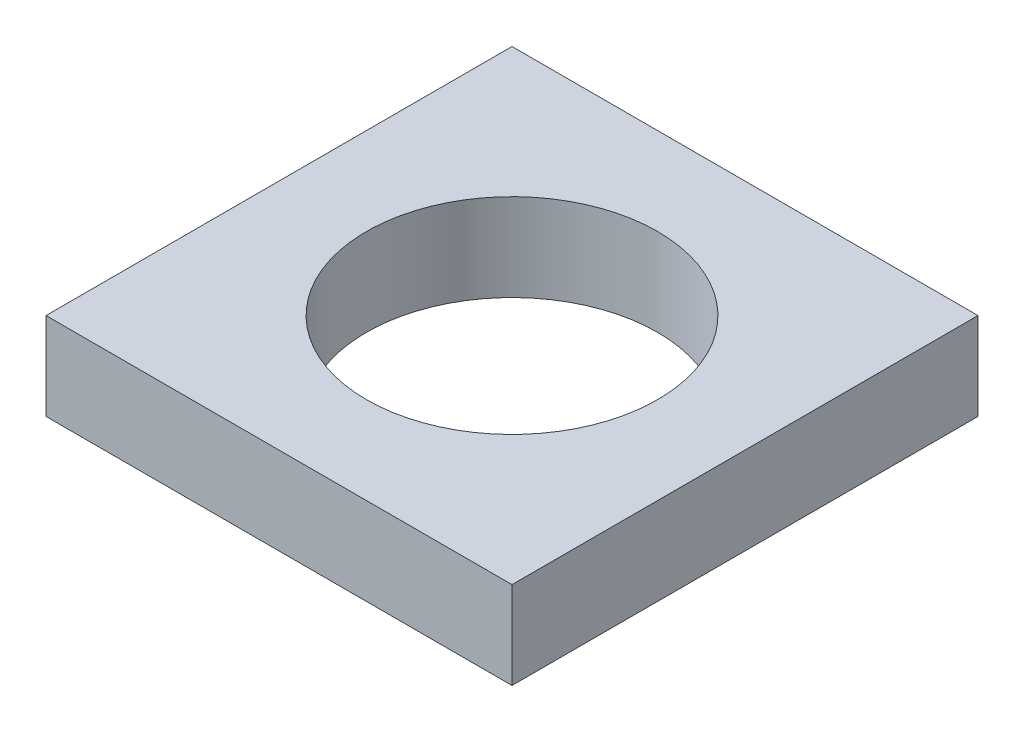
ISO-10303-21;
HEADER;
FILE_DESCRIPTION(('STEP AP214'),'2;1');
FILE_NAME('part.step','',(''),(''),'','','');
FILE_SCHEMA(('AUTOMOTIVE_DESIGN { 1 0 10303 214 1 1 1 1 }'));
ENDSEC;
DATA;
#1=APPLICATION_CONTEXT('core data for automotive mechanical design processes');
#2=APPLICATION_PROTOCOL_DEFINITION('international standard','automotive_design',2000,#1);
#3=PRODUCT_CONTEXT('',#1,'mechanical');
#4=PRODUCT('Part','Part','',(#3));
#5=PRODUCT_RELATED_PRODUCT_CATEGORY('part','',(#4));
#6=PRODUCT_DEFINITION_FORMATION('','',#4);
#7=PRODUCT_DEFINITION_CONTEXT('part definition',#1,'design');
#8=PRODUCT_DEFINITION('design','',#6,#7);
#9=PRODUCT_DEFINITION_SHAPE('','',#8);
#10=(LENGTH_UNIT() NAMED_UNIT(*) SI_UNIT(.MILLI.,.METRE.));
#11=(NAMED_UNIT(*) PLANE_ANGLE_UNIT() SI_UNIT($,.RADIAN.));
#12=(NAMED_UNIT(*) SI_UNIT($,.STERADIAN.) SOLID_ANGLE_UNIT());
#13=UNCERTAINTY_MEASURE_WITH_UNIT(LENGTH_MEASURE(1.E-05),#10,'distance_accuracy_value','');
#14=(GEOMETRIC_REPRESENTATION_CONTEXT(3) GLOBAL_UNCERTAINTY_ASSIGNED_CONTEXT((#13)) GLOBAL_UNIT_ASSIGNED_CONTEXT((#10,
#11,#12)) REPRESENTATION_CONTEXT('',''));
#15=CARTESIAN_POINT('',(0.,0.,0.));
#16=DIRECTION('',(0.,0.,1.));
#17=DIRECTION('',(1.,0.,0.));
#18=AXIS2_PLACEMENT_3D('',#15,#16,#17);
#19=CARTESIAN_POINT('',(-50.8,-8.89,-50.8));
#20=DIRECTION('',(-1.,0.,0.));
#21=DIRECTION('',(0.,0.,1.));
#22=AXIS2_PLACEMENT_3D('',#19,#20,#21);
#23=PLANE('',#22);
#24=DIRECTION('',(0.,1.,0.));
#25=VECTOR('',#24,1.);
#26=CARTESIAN_POINT('',(-50.8,-8.89,50.8));
#27=LINE('',#26,#25);
#28=CARTESIAN_POINT('',(-50.8,-8.89,50.8));
#29=VERTEX_POINT('',#28);
#30=CARTESIAN_POINT('',(-50.8,10.16,50.8));
#31=VERTEX_POINT('',#30);
#32=EDGE_CURVE('E57',#29,#31,#27,.T.);
#33=ORIENTED_EDGE('',*,*,#32,.T.);
#34=DIRECTION('',(0.,0.,1.));
#35=VECTOR('',#34,1.);
#36=CARTESIAN_POINT('',(-50.8,10.16,-50.8));
#37=LINE('',#36,#35);
#38=CARTESIAN_POINT('',(-50.8,10.16,-50.8));
#39=VERTEX_POINT('',#38);
#40=EDGE_CURVE('E94',#39,#31,#37,.T.);
#41=ORIENTED_EDGE('',*,*,#40,.F.);
#42=DIRECTION('',(0.,1.,0.));
#43=VECTOR('',#42,1.);
#44=CARTESIAN_POINT('',(-50.8,-8.89,-50.8));
#45=LINE('',#44,#43);
#46=CARTESIAN_POINT('',(-50.8,-8.89,-50.8));
#47=VERTEX_POINT('',#46);
#48=EDGE_CURVE('E13',#47,#39,#45,.T.);
#49=ORIENTED_EDGE('',*,*,#48,.F.);
#50=DIRECTION('',(0.,0.,1.));
#51=VECTOR('',#50,1.);
#52=CARTESIAN_POINT('',(-50.8,-8.89,-50.8));
#53=LINE('',#52,#51);
#54=EDGE_CURVE('E95',#47,#29,#53,.T.);
#55=ORIENTED_EDGE('',*,*,#54,.T.);
#56=EDGE_LOOP('',(#33,#41,#49,#55));
#57=FACE_BOUND('',#56,.T.);
#58=ADVANCED_FACE('F54',(#57),#23,.T.);
#59=CARTESIAN_POINT('',(50.8,-8.89,-50.8));
#60=DIRECTION('',(0.,0.,-1.));
#61=DIRECTION('',(-1.,0.,0.));
#62=AXIS2_PLACEMENT_3D('',#59,#60,#61);
#63=PLANE('',#62);
#64=ORIENTED_EDGE('',*,*,#48,.T.);
#65=DIRECTION('',(-1.,0.,0.));
#66=VECTOR('',#65,1.);
#67=CARTESIAN_POINT('',(50.8,10.16,-50.8));
#68=LINE('',#67,#66);
#69=CARTESIAN_POINT('',(50.8,10.16,-50.8));
#70=VERTEX_POINT('',#69);
#71=EDGE_CURVE('E112',#70,#39,#68,.T.);
#72=ORIENTED_EDGE('',*,*,#71,.F.);
#73=DIRECTION('',(0.,1.,0.));
#74=VECTOR('',#73,1.);
#75=CARTESIAN_POINT('',(50.8,-8.89,-50.8));
#76=LINE('',#75,#74);
#77=CARTESIAN_POINT('',(50.8,-8.89,-50.8));
#78=VERTEX_POINT('',#77);
#79=EDGE_CURVE('E62',#78,#70,#76,.T.);
#80=ORIENTED_EDGE('',*,*,#79,.F.);
#81=DIRECTION('',(-1.,0.,0.));
#82=VECTOR('',#81,1.);
#83=CARTESIAN_POINT('',(50.8,-8.89,-50.8));
#84=LINE('',#83,#82);
#85=EDGE_CURVE('E100',#78,#47,#84,.T.);
#86=ORIENTED_EDGE('',*,*,#85,.T.);
#87=EDGE_LOOP('',(#64,#72,#80,#86));
#88=FACE_BOUND('',#87,.T.);
#89=ADVANCED_FACE('F136',(#88),#63,.T.);
#90=CARTESIAN_POINT('',(50.8,-8.89,-50.8));
#91=DIRECTION('',(1.,0.,0.));
#92=DIRECTION('',(0.,0.,-1.));
#93=AXIS2_PLACEMENT_3D('',#90,#91,#92);
#94=PLANE('',#93);
#95=ORIENTED_EDGE('',*,*,#79,.T.);
#96=DIRECTION('',(0.,0.,-1.));
#97=VECTOR('',#96,1.);
#98=CARTESIAN_POINT('',(50.8,10.16,-50.8));
#99=LINE('',#98,#97);
#100=CARTESIAN_POINT('',(50.8,10.16,50.8));
#101=VERTEX_POINT('',#100);
#102=EDGE_CURVE('E107',#101,#70,#99,.T.);
#103=ORIENTED_EDGE('',*,*,#102,.F.);
#104=DIRECTION('',(0.,1.,0.));
#105=VECTOR('',#104,1.);
#106=CARTESIAN_POINT('',(50.8,-8.89,50.8));
#107=LINE('',#106,#105);
#108=CARTESIAN_POINT('',(50.8,-8.89,50.8));
#109=VERTEX_POINT('',#108);
#110=EDGE_CURVE('E99',#109,#101,#107,.T.);
#111=ORIENTED_EDGE('',*,*,#110,.F.);
#112=DIRECTION('',(0.,0.,-1.));
#113=VECTOR('',#112,1.);
#114=CARTESIAN_POINT('',(50.8,-8.89,-50.8));
#115=LINE('',#114,#113);
#116=EDGE_CURVE('E125',#109,#78,#115,.T.);
#117=ORIENTED_EDGE('',*,*,#116,.T.);
#118=EDGE_LOOP('',(#95,#103,#111,#117));
#119=FACE_BOUND('',#118,.T.);
#120=ADVANCED_FACE('F133',(#119),#94,.T.);
#121=CARTESIAN_POINT('',(50.8,-8.89,50.8));
#122=DIRECTION('',(0.,0.,1.));
#123=DIRECTION('',(1.,0.,0.));
#124=AXIS2_PLACEMENT_3D('',#121,#122,#123);
#125=PLANE('',#124);
#126=ORIENTED_EDGE('',*,*,#110,.T.);
#127=DIRECTION('',(1.,0.,0.));
#128=VECTOR('',#127,1.);
#129=CARTESIAN_POINT('',(50.8,10.16,50.8));
#130=LINE('',#129,#128);
#131=EDGE_CURVE('E102',#31,#101,#130,.T.);
#132=ORIENTED_EDGE('',*,*,#131,.F.);
#133=ORIENTED_EDGE('',*,*,#32,.F.);
#134=DIRECTION('',(1.,0.,0.));
#135=VECTOR('',#134,1.);
#136=CARTESIAN_POINT('',(50.8,-8.89,50.8));
#137=LINE('',#136,#135);
#138=EDGE_CURVE('E124',#29,#109,#137,.T.);
#139=ORIENTED_EDGE('',*,*,#138,.T.);
#140=EDGE_LOOP('',(#126,#132,#133,#139));
#141=FACE_BOUND('',#140,.T.);
#142=ADVANCED_FACE('F103',(#141),#125,.T.);
#143=CARTESIAN_POINT('',(0.,-8.89,0.));
#144=DIRECTION('',(0.,-1.,0.));
#145=DIRECTION('',(0.,0.,-1.));
#146=AXIS2_PLACEMENT_3D('',#143,#144,#145);
#147=PLANE('',#146);
#148=CARTESIAN_POINT('',(0.,-8.89,0.));
#149=DIRECTION('',(0.,1.,0.));
#150=DIRECTION('',(0.,0.,1.));
#151=AXIS2_PLACEMENT_3D('',#148,#149,#150);
#152=CIRCLE('',#151,31.75);
#153=CARTESIAN_POINT('',(0.,-8.89,31.75));
#154=VERTEX_POINT('',#153);
#155=EDGE_CURVE('E120',#154,#154,#152,.T.);
#156=ORIENTED_EDGE('',*,*,#155,.T.);
#157=EDGE_LOOP('',(#156));
#158=FACE_BOUND('',#157,.T.);
#159=ORIENTED_EDGE('',*,*,#54,.F.);
#160=ORIENTED_EDGE('',*,*,#85,.F.);
#161=ORIENTED_EDGE('',*,*,#116,.F.);
#162=ORIENTED_EDGE('',*,*,#138,.F.);
#163=EDGE_LOOP('',(#159,#160,#161,#162));
#164=FACE_BOUND('',#163,.T.);
#165=ADVANCED_FACE('F138',(#158,#164),#147,.T.);
#166=CARTESIAN_POINT('',(0.,-8.89,0.));
#167=DIRECTION('',(0.,1.,0.));
#168=DIRECTION('',(0.,0.,1.));
#169=AXIS2_PLACEMENT_3D('',#166,#167,#168);
#170=CYLINDRICAL_SURFACE('',#169,31.75);
#171=ORIENTED_EDGE('',*,*,#155,.F.);
#172=EDGE_LOOP('',(#171));
#173=FACE_BOUND('',#172,.T.);
#174=CARTESIAN_POINT('',(0.,10.16,0.));
#175=DIRECTION('',(0.,1.,0.));
#176=DIRECTION('',(0.,0.,1.));
#177=AXIS2_PLACEMENT_3D('',#174,#175,#176);
#178=CIRCLE('',#177,31.75);
#179=CARTESIAN_POINT('',(0.,10.16,31.75));
#180=VERTEX_POINT('',#179);
#181=EDGE_CURVE('E113',#180,#180,#178,.T.);
#182=ORIENTED_EDGE('',*,*,#181,.T.);
#183=EDGE_LOOP('',(#182));
#184=FACE_BOUND('',#183,.T.);
#185=ADVANCED_FACE('F140',(#173,#184),#170,.F.);
#186=CARTESIAN_POINT('',(0.,10.16,0.));
#187=DIRECTION('',(0.,-1.,0.));
#188=DIRECTION('',(0.,0.,-1.));
#189=AXIS2_PLACEMENT_3D('',#186,#187,#188);
#190=PLANE('',#189);
#191=ORIENTED_EDGE('',*,*,#40,.T.);
#192=ORIENTED_EDGE('',*,*,#131,.T.);
#193=ORIENTED_EDGE('',*,*,#102,.T.);
#194=ORIENTED_EDGE('',*,*,#71,.T.);
#195=EDGE_LOOP('',(#191,#192,#193,#194));
#196=FACE_BOUND('',#195,.T.);
#197=ORIENTED_EDGE('',*,*,#181,.F.);
#198=EDGE_LOOP('',(#197));
#199=FACE_BOUND('',#198,.T.);
#200=ADVANCED_FACE('F110',(#196,#199),#190,.F.);
#201=CLOSED_SHELL('',(#58,#89,#120,#142,#165,#185,#200));
#202=MANIFOLD_SOLID_BREP('B2_NOT_SHOWN',#201);
#203=CARTESIAN_POINT('',(0.,9.525,0.));
#204=DIRECTION('',(0.,-1.,0.));
#205=DIRECTION('',(0.,0.,-1.));
#206=AXIS2_PLACEMENT_3D('',#203,#204,#205);
#207=CYLINDRICAL_SURFACE('',#206,42.4942);
#208=CARTESIAN_POINT('',(0.,9.525,0.));
#209=DIRECTION('',(0.,1.,0.));
#210=DIRECTION('',(0.,0.,1.));
#211=AXIS2_PLACEMENT_3D('',#208,#209,#210);
#212=CIRCLE('',#211,42.4942);
#213=CARTESIAN_POINT('',(0.,9.525,-42.4942));
#214=VERTEX_POINT('',#213);
#215=EDGE_CURVE('E241',#214,#214,#212,.T.);
#216=CARTESIAN_POINT('',(0.,0.,0.));
#217=DIRECTION('',(0.,1.,0.));
#218=DIRECTION('',(0.,0.,1.));
#219=AXIS2_PLACEMENT_3D('',#216,#217,#218);
#220=CIRCLE('',#219,42.4942);
#221=CARTESIAN_POINT('',(0.,0.,-42.4942));
#222=VERTEX_POINT('',#221);
#223=EDGE_CURVE('E246',#222,#222,#220,.T.);
#224=CARTESIAN_POINT('',(0.,9.525,-42.4942));
#225=CARTESIAN_POINT('',(0.,9.42578125,-42.4942));
#226=CARTESIAN_POINT('',(0.,9.3265625,-42.4942));
#227=CARTESIAN_POINT('',(0.,9.128125,-42.4942));
#228=CARTESIAN_POINT('',(0.,9.02890625,-42.4942));
#229=CARTESIAN_POINT('',(0.,8.83046875,-42.4942));
#230=CARTESIAN_POINT('',(0.,8.73125,-42.4942));
#231=CARTESIAN_POINT('',(0.,8.5328125,-42.4942));
#232=CARTESIAN_POINT('',(0.,8.43359375,-42.4942));
#233=CARTESIAN_POINT('',(0.,8.23515625,-42.4942));
#234=CARTESIAN_POINT('',(0.,8.1359375,-42.4942));
#235=CARTESIAN_POINT('',(0.,7.9375,-42.4942));
#236=CARTESIAN_POINT('',(0.,7.83828125,-42.4942));
#237=CARTESIAN_POINT('',(0.,7.63984375,-42.4942));
#238=CARTESIAN_POINT('',(0.,7.540625,-42.4942));
#239=CARTESIAN_POINT('',(0.,7.3421875,-42.4942));
#240=CARTESIAN_POINT('',(0.,7.24296875,-42.4942));
#241=CARTESIAN_POINT('',(0.,7.04453125,-42.4942));
#242=CARTESIAN_POINT('',(0.,6.9453125,-42.4942));
#243=CARTESIAN_POINT('',(0.,6.746875,-42.4942));
#244=CARTESIAN_POINT('',(0.,6.64765625,-42.4942));
#245=CARTESIAN_POINT('',(0.,6.44921875,-42.4942));
#246=CARTESIAN_POINT('',(0.,6.35,-42.4942));
#247=CARTESIAN_POINT('',(0.,6.1515625,-42.4942));
#248=CARTESIAN_POINT('',(0.,6.05234375,-42.4942));
#249=CARTESIAN_POINT('',(0.,5.85390625,-42.4942));
#250=CARTESIAN_POINT('',(0.,5.7546875,-42.4942));
#251=CARTESIAN_POINT('',(0.,5.55625,-42.4942));
#252=CARTESIAN_POINT('',(0.,5.45703125,-42.4942));
#253=CARTESIAN_POINT('',(0.,5.25859375,-42.4942));
#254=CARTESIAN_POINT('',(0.,5.159375,-42.4942));
#255=CARTESIAN_POINT('',(0.,4.9609375,-42.4942));
#256=CARTESIAN_POINT('',(0.,4.86171875,-42.4942));
#257=CARTESIAN_POINT('',(0.,4.66328125,-42.4942));
#258=CARTESIAN_POINT('',(0.,4.5640625,-42.4942));
#259=CARTESIAN_POINT('',(0.,4.365625,-42.4942));
#260=CARTESIAN_POINT('',(0.,4.26640625,-42.4942));
#261=CARTESIAN_POINT('',(0.,4.06796875,-42.4942));
#262=CARTESIAN_POINT('',(0.,3.96875,-42.4942));
#263=CARTESIAN_POINT('',(0.,3.7703125,-42.4942));
#264=CARTESIAN_POINT('',(0.,3.67109375,-42.4942));
#265=CARTESIAN_POINT('',(0.,3.47265625,-42.4942));
#266=CARTESIAN_POINT('',(0.,3.3734375,-42.4942));
#267=CARTESIAN_POINT('',(0.,3.175,-42.4942));
#268=CARTESIAN_POINT('',(0.,3.07578125,-42.4942));
#269=CARTESIAN_POINT('',(0.,2.87734375,-42.4942));
#270=CARTESIAN_POINT('',(0.,2.778125,-42.4942));
#271=CARTESIAN_POINT('',(0.,2.5796875,-42.4942));
#272=CARTESIAN_POINT('',(0.,2.48046875,-42.4942));
#273=CARTESIAN_POINT('',(0.,2.28203125,-42.4942));
#274=CARTESIAN_POINT('',(0.,2.1828125,-42.4942));
#275=CARTESIAN_POINT('',(0.,1.984375,-42.4942));
#276=CARTESIAN_POINT('',(0.,1.88515625,-42.4942));
#277=CARTESIAN_POINT('',(0.,1.68671875,-42.4942));
#278=CARTESIAN_POINT('',(0.,1.5875,-42.4942));
#279=CARTESIAN_POINT('',(0.,1.3890625,-42.4942));
#280=CARTESIAN_POINT('',(0.,1.28984375,-42.4942));
#281=CARTESIAN_POINT('',(0.,1.09140625,-42.4942));
#282=CARTESIAN_POINT('',(0.,0.992187500000001,-42.4942));
#283=CARTESIAN_POINT('',(0.,0.793750000000001,-42.4942));
#284=CARTESIAN_POINT('',(0.,0.69453125,-42.4942));
#285=CARTESIAN_POINT('',(0.,0.49609375,-42.4942));
#286=CARTESIAN_POINT('',(0.,0.396875,-42.4942));
#287=CARTESIAN_POINT('',(0.,0.1984375,-42.4942));
#288=CARTESIAN_POINT('',(0.,0.0992187500000001,-42.4942));
#289=CARTESIAN_POINT('',(0.,0.,-42.4942));
#290=B_SPLINE_CURVE_WITH_KNOTS('',3,(#224,#225,#226,#227,#228,#229,#230,#231,#232,#233,#234,
#235,#236,#237,#238,#239,#240,#241,#242,#243,#244,#245,#246,#247,#248,#249,#250,#251,#252,#253,
#254,#255,#256,#257,#258,#259,#260,#261,#262,#263,#264,#265,#266,#267,#268,#269,#270,#271,#272,
#273,#274,#275,#276,#277,#278,#279,#280,#281,#282,#283,#284,#285,#286,#287,#288,#289),
.UNSPECIFIED.,.F.,.F.,(4,2,2,2,2,2,2,2,2,2,2,2,2,2,2,2,2,2,2,2,2,2,2,2,2,2,2,2,2,2,2,2,4),(0.,
0.29765625,0.5953125,0.892968750000001,1.190625,1.48828125,1.7859375,2.08359375,2.38125,
2.67890625,2.9765625,3.27421875,3.571875,3.86953125,4.1671875,4.46484375,4.7625,5.06015625,
5.3578125,5.65546875,5.953125,6.25078125,6.5484375,6.84609375,7.14375,7.44140625,7.7390625,
8.03671875,8.334375,8.63203125,8.9296875,9.22734375,9.525),.UNSPECIFIED.);
#291=EDGE_CURVE('BSEAM231',#214,#222,#290,.T.);
#292=ORIENTED_EDGE('',*,*,#215,.F.);
#293=ORIENTED_EDGE('',*,*,#223,.T.);
#294=ORIENTED_EDGE('',*,*,#291,.T.);
#295=ORIENTED_EDGE('',*,*,#291,.F.);
#296=EDGE_LOOP('',(#292,#294,#293,#295));
#297=FACE_BOUND('',#296,.T.);
#298=ADVANCED_FACE('F231',(#297),#207,.T.);
#299=CARTESIAN_POINT('',(0.,9.525,0.));
#300=DIRECTION('',(0.,-1.,0.));
#301=DIRECTION('',(0.,0.,-1.));
#302=AXIS2_PLACEMENT_3D('',#299,#300,#301);
#303=CYLINDRICAL_SURFACE('',#302,40.005);
#304=CARTESIAN_POINT('',(0.,2.54,0.));
#305=DIRECTION('',(0.,1.,0.));
#306=DIRECTION('',(0.,0.,1.));
#307=AXIS2_PLACEMENT_3D('',#304,#305,#306);
#308=CIRCLE('',#307,40.005);
#309=CARTESIAN_POINT('',(0.,2.54,-40.005));
#310=VERTEX_POINT('',#309);
#311=EDGE_CURVE('E53',#310,#310,#308,.T.);
#312=CARTESIAN_POINT('',(0.,9.525,0.));
#313=DIRECTION('',(0.,1.,0.));
#314=DIRECTION('',(0.,0.,1.));
#315=AXIS2_PLACEMENT_3D('',#312,#313,#314);
#316=CIRCLE('',#315,40.005);
#317=CARTESIAN_POINT('',(0.,9.525,-40.005));
#318=VERTEX_POINT('',#317);
#319=EDGE_CURVE('E237',#318,#318,#316,.T.);
#320=CARTESIAN_POINT('',(0.,2.54,-40.005));
#321=CARTESIAN_POINT('',(0.,2.61276041666667,-40.005));
#322=CARTESIAN_POINT('',(0.,2.68552083333333,-40.005));
#323=CARTESIAN_POINT('',(0.,2.83104166666667,-40.005));
#324=CARTESIAN_POINT('',(0.,2.90380208333333,-40.005));
#325=CARTESIAN_POINT('',(0.,3.04932291666667,-40.005));
#326=CARTESIAN_POINT('',(0.,3.12208333333333,-40.005));
#327=CARTESIAN_POINT('',(0.,3.26760416666667,-40.005));
#328=CARTESIAN_POINT('',(0.,3.34036458333333,-40.005));
#329=CARTESIAN_POINT('',(0.,3.48588541666667,-40.005));
#330=CARTESIAN_POINT('',(0.,3.55864583333333,-40.005));
#331=CARTESIAN_POINT('',(0.,3.70416666666667,-40.005));
#332=CARTESIAN_POINT('',(0.,3.77692708333333,-40.005));
#333=CARTESIAN_POINT('',(0.,3.92244791666667,-40.005));
#334=CARTESIAN_POINT('',(0.,3.99520833333333,-40.005));
#335=CARTESIAN_POINT('',(0.,4.14072916666667,-40.005));
#336=CARTESIAN_POINT('',(0.,4.21348958333333,-40.005));
#337=CARTESIAN_POINT('',(0.,4.35901041666667,-40.005));
#338=CARTESIAN_POINT('',(0.,4.43177083333333,-40.005));
#339=CARTESIAN_POINT('',(0.,4.57729166666667,-40.005));
#340=CARTESIAN_POINT('',(0.,4.65005208333333,-40.005));
#341=CARTESIAN_POINT('',(0.,4.79557291666667,-40.005));
#342=CARTESIAN_POINT('',(0.,4.86833333333333,-40.005));
#343=CARTESIAN_POINT('',(0.,5.01385416666667,-40.005));
#344=CARTESIAN_POINT('',(0.,5.08661458333333,-40.005));
#345=CARTESIAN_POINT('',(0.,5.23213541666667,-40.005));
#346=CARTESIAN_POINT('',(0.,5.30489583333333,-40.005));
#347=CARTESIAN_POINT('',(0.,5.45041666666667,-40.005));
#348=CARTESIAN_POINT('',(0.,5.52317708333333,-40.005));
#349=CARTESIAN_POINT('',(0.,5.66869791666667,-40.005));
#350=CARTESIAN_POINT('',(0.,5.74145833333333,-40.005));
#351=CARTESIAN_POINT('',(0.,5.88697916666667,-40.005));
#352=CARTESIAN_POINT('',(0.,5.95973958333333,-40.005));
#353=CARTESIAN_POINT('',(0.,6.10526041666667,-40.005));
#354=CARTESIAN_POINT('',(0.,6.17802083333333,-40.005));
#355=CARTESIAN_POINT('',(0.,6.32354166666667,-40.005));
#356=CARTESIAN_POINT('',(0.,6.39630208333333,-40.005));
#357=CARTESIAN_POINT('',(0.,6.54182291666667,-40.005));
#358=CARTESIAN_POINT('',(0.,6.61458333333333,-40.005));
#359=CARTESIAN_POINT('',(0.,6.76010416666667,-40.005));
#360=CARTESIAN_POINT('',(0.,6.83286458333333,-40.005));
#361=CARTESIAN_POINT('',(0.,6.97838541666667,-40.005));
#362=CARTESIAN_POINT('',(0.,7.05114583333333,-40.005));
#363=CARTESIAN_POINT('',(0.,7.19666666666667,-40.005));
#364=CARTESIAN_POINT('',(0.,7.26942708333333,-40.005));
#365=CARTESIAN_POINT('',(0.,7.41494791666667,-40.005));
#366=CARTESIAN_POINT('',(0.,7.48770833333333,-40.005));
#367=CARTESIAN_POINT('',(0.,7.63322916666667,-40.005));
#368=CARTESIAN_POINT('',(0.,7.70598958333333,-40.005));
#369=CARTESIAN_POINT('',(0.,7.85151041666667,-40.005));
#370=CARTESIAN_POINT('',(0.,7.92427083333333,-40.005));
#371=CARTESIAN_POINT('',(0.,8.06979166666667,-40.005));
#372=CARTESIAN_POINT('',(0.,8.14255208333333,-40.005));
#373=CARTESIAN_POINT('',(0.,8.28807291666667,-40.005));
#374=CARTESIAN_POINT('',(0.,8.36083333333333,-40.005));
#375=CARTESIAN_POINT('',(0.,8.50635416666667,-40.005));
#376=CARTESIAN_POINT('',(0.,8.57911458333333,-40.005));
#377=CARTESIAN_POINT('',(0.,8.72463541666667,-40.005));
#378=CARTESIAN_POINT('',(0.,8.79739583333333,-40.005));
#379=CARTESIAN_POINT('',(0.,8.94291666666667,-40.005));
#380=CARTESIAN_POINT('',(0.,9.01567708333333,-40.005));
#381=CARTESIAN_POINT('',(0.,9.16119791666667,-40.005));
#382=CARTESIAN_POINT('',(0.,9.23395833333333,-40.005));
#383=CARTESIAN_POINT('',(0.,9.37947916666667,-40.005));
#384=CARTESIAN_POINT('',(0.,9.45223958333333,-40.005));
#385=CARTESIAN_POINT('',(0.,9.525,-40.005));
#386=B_SPLINE_CURVE_WITH_KNOTS('',3,(#320,#321,#322,#323,#324,#325,#326,#327,#328,#329,#330,
#331,#332,#333,#334,#335,#336,#337,#338,#339,#340,#341,#342,#343,#344,#345,#346,#347,#348,#349,
#350,#351,#352,#353,#354,#355,#356,#357,#358,#359,#360,#361,#362,#363,#364,#365,#366,#367,#368,
#369,#370,#371,#372,#373,#374,#375,#376,#377,#378,#379,#380,#381,#382,#383,#384,#385),
.UNSPECIFIED.,.F.,.F.,(4,2,2,2,2,2,2,2,2,2,2,2,2,2,2,2,2,2,2,2,2,2,2,2,2,2,2,2,2,2,2,2,4),(0.,
0.21828125,0.4365625,0.65484375,0.873125,1.09140625,1.3096875,1.52796875,1.74625,1.96453125,
2.1828125,2.40109375,2.619375,2.83765625,3.0559375,3.27421875,3.4925,3.71078125,3.9290625,
4.14734375,4.365625,4.58390625,4.8021875,5.02046875,5.23875,5.45703125,5.6753125,5.89359375,
6.111875,6.33015625,6.5484375,6.76671875,6.985),.UNSPECIFIED.);
#387=EDGE_CURVE('BSEAM294',#310,#318,#386,.T.);
#388=ORIENTED_EDGE('',*,*,#311,.F.);
#389=ORIENTED_EDGE('',*,*,#319,.T.);
#390=ORIENTED_EDGE('',*,*,#387,.T.);
#391=ORIENTED_EDGE('',*,*,#387,.F.);
#392=EDGE_LOOP('',(#388,#390,#389,#391));
#393=FACE_BOUND('',#392,.T.);
#394=ADVANCED_FACE('F294',(#393),#303,.F.);
#395=CARTESIAN_POINT('',(0.,9.525,0.));
#396=DIRECTION('',(0.,1.,0.));
#397=DIRECTION('',(0.,0.,1.));
#398=AXIS2_PLACEMENT_3D('',#395,#396,#397);
#399=PLANE('',#398);
#400=ORIENTED_EDGE('',*,*,#215,.T.);
#401=EDGE_LOOP('',(#400));
#402=FACE_BOUND('',#401,.T.);
#403=ORIENTED_EDGE('',*,*,#319,.F.);
#404=EDGE_LOOP('',(#403));
#405=FACE_BOUND('',#404,.T.);
#406=ADVANCED_FACE('F285',(#402,#405),#399,.T.);
#407=CARTESIAN_POINT('',(0.,0.,0.));
#408=DIRECTION('',(0.,1.,0.));
#409=DIRECTION('',(0.,0.,1.));
#410=AXIS2_PLACEMENT_3D('',#407,#408,#409);
#411=PLANE('',#410);
#412=CARTESIAN_POINT('',(0.,0.,0.));
#413=DIRECTION('',(0.,1.,0.));
#414=DIRECTION('',(0.,0.,1.));
#415=AXIS2_PLACEMENT_3D('',#412,#413,#414);
#416=CIRCLE('',#415,40.5003);
#417=CARTESIAN_POINT('',(0.,0.,40.5003));
#418=VERTEX_POINT('',#417);
#419=EDGE_CURVE('E266',#418,#418,#416,.T.);
#420=ORIENTED_EDGE('',*,*,#419,.T.);
#421=EDGE_LOOP('',(#420));
#422=FACE_BOUND('',#421,.T.);
#423=ORIENTED_EDGE('',*,*,#223,.F.);
#424=EDGE_LOOP('',(#423));
#425=FACE_BOUND('',#424,.T.);
#426=ADVANCED_FACE('F282',(#422,#425),#411,.F.);
#427=CARTESIAN_POINT('',(0.,2.54,0.));
#428=DIRECTION('',(0.,-1.,0.));
#429=DIRECTION('',(0.,0.,-1.));
#430=AXIS2_PLACEMENT_3D('',#427,#428,#429);
#431=CYLINDRICAL_SURFACE('',#430,37.9984);
#432=CARTESIAN_POINT('',(0.,2.54,0.));
#433=DIRECTION('',(0.,1.,0.));
#434=DIRECTION('',(0.,0.,1.));
#435=AXIS2_PLACEMENT_3D('',#432,#433,#434);
#436=CIRCLE('',#435,37.9984);
#437=CARTESIAN_POINT('',(0.,2.54,37.9984));
#438=VERTEX_POINT('',#437);
#439=EDGE_CURVE('E270',#438,#438,#436,.T.);
#440=ORIENTED_EDGE('',*,*,#439,.T.);
#441=EDGE_LOOP('',(#440));
#442=FACE_BOUND('',#441,.T.);
#443=CARTESIAN_POINT('',(0.,-7.62,0.));
#444=DIRECTION('',(0.,1.,0.));
#445=DIRECTION('',(0.,0.,1.));
#446=AXIS2_PLACEMENT_3D('',#443,#444,#445);
#447=CIRCLE('',#446,37.9984);
#448=CARTESIAN_POINT('',(0.,-7.62,37.9984));
#449=VERTEX_POINT('',#448);
#450=EDGE_CURVE('E261',#449,#449,#447,.T.);
#451=ORIENTED_EDGE('',*,*,#450,.F.);
#452=EDGE_LOOP('',(#451));
#453=FACE_BOUND('',#452,.T.);
#454=ADVANCED_FACE('F284',(#442,#453),#431,.F.);
#455=CARTESIAN_POINT('',(0.,2.54,0.));
#456=DIRECTION('',(0.,1.,0.));
#457=DIRECTION('',(0.,0.,1.));
#458=AXIS2_PLACEMENT_3D('',#455,#456,#457);
#459=PLANE('',#458);
#460=ORIENTED_EDGE('',*,*,#439,.F.);
#461=EDGE_LOOP('',(#460));
#462=FACE_BOUND('',#461,.T.);
#463=ORIENTED_EDGE('',*,*,#311,.T.);
#464=EDGE_LOOP('',(#463));
#465=FACE_BOUND('',#464,.T.);
#466=ADVANCED_FACE('F292',(#462,#465),#459,.T.);
#467=CARTESIAN_POINT('',(0.,-7.62,0.));
#468=DIRECTION('',(0.,1.,0.));
#469=DIRECTION('',(0.,0.,1.));
#470=AXIS2_PLACEMENT_3D('',#467,#468,#469);
#471=CYLINDRICAL_SURFACE('',#470,40.5003);
#472=CARTESIAN_POINT('',(0.,-7.62,0.));
#473=DIRECTION('',(0.,1.,0.));
#474=DIRECTION('',(0.,0.,1.));
#475=AXIS2_PLACEMENT_3D('',#472,#473,#474);
#476=CIRCLE('',#475,40.5003);
#477=CARTESIAN_POINT('',(0.,-7.62,40.5003));
#478=VERTEX_POINT('',#477);
#479=EDGE_CURVE('E265',#478,#478,#476,.T.);
#480=CARTESIAN_POINT('',(0.,-7.62,40.5003));
#481=CARTESIAN_POINT('',(0.,-7.540625,40.5003));
#482=CARTESIAN_POINT('',(0.,-7.46125,40.5003));
#483=CARTESIAN_POINT('',(0.,-7.3025,40.5003));
#484=CARTESIAN_POINT('',(0.,-7.223125,40.5003));
#485=CARTESIAN_POINT('',(0.,-7.064375,40.5003));
#486=CARTESIAN_POINT('',(0.,-6.985,40.5003));
#487=CARTESIAN_POINT('',(0.,-6.82625,40.5003));
#488=CARTESIAN_POINT('',(0.,-6.746875,40.5003));
#489=CARTESIAN_POINT('',(0.,-6.588125,40.5003));
#490=CARTESIAN_POINT('',(0.,-6.50875,40.5003));
#491=CARTESIAN_POINT('',(0.,-6.35,40.5003));
#492=CARTESIAN_POINT('',(0.,-6.270625,40.5003));
#493=CARTESIAN_POINT('',(0.,-6.111875,40.5003));
#494=CARTESIAN_POINT('',(0.,-6.0325,40.5003));
#495=CARTESIAN_POINT('',(0.,-5.87375,40.5003));
#496=CARTESIAN_POINT('',(0.,-5.794375,40.5003));
#497=CARTESIAN_POINT('',(0.,-5.635625,40.5003));
#498=CARTESIAN_POINT('',(0.,-5.55625,40.5003));
#499=CARTESIAN_POINT('',(0.,-5.3975,40.5003));
#500=CARTESIAN_POINT('',(0.,-5.318125,40.5003));
#501=CARTESIAN_POINT('',(0.,-5.159375,40.5003));
#502=CARTESIAN_POINT('',(0.,-5.08,40.5003));
#503=CARTESIAN_POINT('',(0.,-4.92125,40.5003));
#504=CARTESIAN_POINT('',(0.,-4.841875,40.5003));
#505=CARTESIAN_POINT('',(0.,-4.683125,40.5003));
#506=CARTESIAN_POINT('',(0.,-4.60375,40.5003));
#507=CARTESIAN_POINT('',(0.,-4.445,40.5003));
#508=CARTESIAN_POINT('',(0.,-4.365625,40.5003));
#509=CARTESIAN_POINT('',(0.,-4.206875,40.5003));
#510=CARTESIAN_POINT('',(0.,-4.1275,40.5003));
#511=CARTESIAN_POINT('',(0.,-3.96875,40.5003));
#512=CARTESIAN_POINT('',(0.,-3.889375,40.5003));
#513=CARTESIAN_POINT('',(0.,-3.730625,40.5003));
#514=CARTESIAN_POINT('',(0.,-3.65125,40.5003));
#515=CARTESIAN_POINT('',(0.,-3.4925,40.5003));
#516=CARTESIAN_POINT('',(0.,-3.413125,40.5003));
#517=CARTESIAN_POINT('',(0.,-3.254375,40.5003));
#518=CARTESIAN_POINT('',(0.,-3.175,40.5003));
#519=CARTESIAN_POINT('',(0.,-3.01625,40.5003));
#520=CARTESIAN_POINT('',(0.,-2.936875,40.5003));
#521=CARTESIAN_POINT('',(0.,-2.778125,40.5003));
#522=CARTESIAN_POINT('',(0.,-2.69875,40.5003));
#523=CARTESIAN_POINT('',(0.,-2.54,40.5003));
#524=CARTESIAN_POINT('',(0.,-2.460625,40.5003));
#525=CARTESIAN_POINT('',(0.,-2.301875,40.5003));
#526=CARTESIAN_POINT('',(0.,-2.2225,40.5003));
#527=CARTESIAN_POINT('',(0.,-2.06375,40.5003));
#528=CARTESIAN_POINT('',(0.,-1.984375,40.5003));
#529=CARTESIAN_POINT('',(0.,-1.825625,40.5003));
#530=CARTESIAN_POINT('',(0.,-1.74625,40.5003));
#531=CARTESIAN_POINT('',(0.,-1.5875,40.5003));
#532=CARTESIAN_POINT('',(0.,-1.508125,40.5003));
#533=CARTESIAN_POINT('',(0.,-1.349375,40.5003));
#534=CARTESIAN_POINT('',(0.,-1.27,40.5003));
#535=CARTESIAN_POINT('',(0.,-1.11125,40.5003));
#536=CARTESIAN_POINT('',(0.,-1.031875,40.5003));
#537=CARTESIAN_POINT('',(0.,-0.873125,40.5003));
#538=CARTESIAN_POINT('',(0.,-0.79375,40.5003));
#539=CARTESIAN_POINT('',(0.,-0.635,40.5003));
#540=CARTESIAN_POINT('',(0.,-0.555625,40.5003));
#541=CARTESIAN_POINT('',(0.,-0.396875,40.5003));
#542=CARTESIAN_POINT('',(0.,-0.3175,40.5003));
#543=CARTESIAN_POINT('',(0.,-0.15875,40.5003));
#544=CARTESIAN_POINT('',(0.,-0.0793749999999999,40.5003));
#545=CARTESIAN_POINT('',(0.,0.,40.5003));
#546=B_SPLINE_CURVE_WITH_KNOTS('',3,(#480,#481,#482,#483,#484,#485,#486,#487,#488,#489,#490,
#491,#492,#493,#494,#495,#496,#497,#498,#499,#500,#501,#502,#503,#504,#505,#506,#507,#508,#509,
#510,#511,#512,#513,#514,#515,#516,#517,#518,#519,#520,#521,#522,#523,#524,#525,#526,#527,#528,
#529,#530,#531,#532,#533,#534,#535,#536,#537,#538,#539,#540,#541,#542,#543,#544,#545),
.UNSPECIFIED.,.F.,.F.,(4,2,2,2,2,2,2,2,2,2,2,2,2,2,2,2,2,2,2,2,2,2,2,2,2,2,2,2,2,2,2,2,4),(0.,
0.238125,0.476249999999999,0.714375,0.952499999999999,1.190625,1.42875,1.666875,1.905,2.143125,
2.38125,2.619375,2.8575,3.095625,3.33375,3.571875,3.81,4.048125,4.28625,4.524375,4.7625,
5.000625,5.23875,5.476875,5.715,5.953125,6.19125,6.429375,6.6675,6.905625,7.14375,7.381875,
7.62),.UNSPECIFIED.);
#547=EDGE_CURVE('BSEAM332',#478,#418,#546,.T.);
#548=ORIENTED_EDGE('',*,*,#479,.T.);
#549=ORIENTED_EDGE('',*,*,#419,.F.);
#550=ORIENTED_EDGE('',*,*,#547,.T.);
#551=ORIENTED_EDGE('',*,*,#547,.F.);
#552=EDGE_LOOP('',(#548,#550,#549,#551));
#553=FACE_BOUND('',#552,.T.);
#554=ADVANCED_FACE('F332',(#553),#471,.T.);
#555=CARTESIAN_POINT('',(0.,-7.62,0.));
#556=DIRECTION('',(0.,1.,0.));
#557=DIRECTION('',(0.,0.,1.));
#558=AXIS2_PLACEMENT_3D('',#555,#556,#557);
#559=PLANE('',#558);
#560=ORIENTED_EDGE('',*,*,#450,.T.);
#561=EDGE_LOOP('',(#560));
#562=FACE_BOUND('',#561,.T.);
#563=ORIENTED_EDGE('',*,*,#479,.F.);
#564=EDGE_LOOP('',(#563));
#565=FACE_BOUND('',#564,.T.);
#566=ADVANCED_FACE('F341',(#562,#565),#559,.F.);
#567=CLOSED_SHELL('',(#298,#394,#406,#426,#454,#466,#554,#566));
#568=MANIFOLD_SOLID_BREP('B7',#567);
#569=ADVANCED_BREP_SHAPE_REPRESENTATION('',(#18,#202,#568),#14);
#570=SHAPE_DEFINITION_REPRESENTATION(#9,#569);
ENDSEC;
END-ISO-10303-21;
